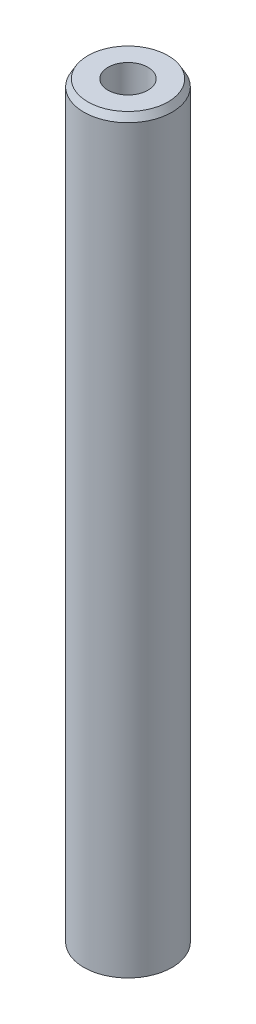
ISO-10303-21;
HEADER;
FILE_DESCRIPTION(('STEP AP214'),'2;1');
FILE_NAME('part.step','',(''),(''),'','','');
FILE_SCHEMA(('AUTOMOTIVE_DESIGN { 1 0 10303 214 1 1 1 1 }'));
ENDSEC;
DATA;
#1=APPLICATION_CONTEXT('core data for automotive mechanical design processes');
#2=APPLICATION_PROTOCOL_DEFINITION('international standard','automotive_design',2000,#1);
#3=PRODUCT_CONTEXT('',#1,'mechanical');
#4=PRODUCT('Part','Part','',(#3));
#5=PRODUCT_RELATED_PRODUCT_CATEGORY('part','',(#4));
#6=PRODUCT_DEFINITION_FORMATION('','',#4);
#7=PRODUCT_DEFINITION_CONTEXT('part definition',#1,'design');
#8=PRODUCT_DEFINITION('design','',#6,#7);
#9=PRODUCT_DEFINITION_SHAPE('','',#8);
#10=(LENGTH_UNIT() NAMED_UNIT(*) SI_UNIT(.MILLI.,.METRE.));
#11=(NAMED_UNIT(*) PLANE_ANGLE_UNIT() SI_UNIT($,.RADIAN.));
#12=(NAMED_UNIT(*) SI_UNIT($,.STERADIAN.) SOLID_ANGLE_UNIT());
#13=UNCERTAINTY_MEASURE_WITH_UNIT(LENGTH_MEASURE(1.E-05),#10,'distance_accuracy_value','');
#14=(GEOMETRIC_REPRESENTATION_CONTEXT(3) GLOBAL_UNCERTAINTY_ASSIGNED_CONTEXT((#13)) GLOBAL_UNIT_ASSIGNED_CONTEXT((#10,
#11,#12)) REPRESENTATION_CONTEXT('',''));
#15=CARTESIAN_POINT('',(0.,0.,0.));
#16=DIRECTION('',(0.,0.,1.));
#17=DIRECTION('',(1.,0.,0.));
#18=AXIS2_PLACEMENT_3D('',#15,#16,#17);
#19=CARTESIAN_POINT('',(0.,596.406810650082,0.));
#20=DIRECTION('',(0.,-1.,0.));
#21=DIRECTION('',(0.,0.,-1.));
#22=AXIS2_PLACEMENT_3D('',#19,#20,#21);
#23=CYLINDRICAL_SURFACE('',#22,35.);
#24=CARTESIAN_POINT('',(0.,590.915027687392,0.));
#25=DIRECTION('',(0.,1.,0.));
#26=DIRECTION('',(0.,0.,1.));
#27=AXIS2_PLACEMENT_3D('',#24,#25,#26);
#28=CIRCLE('',#27,35.);
#29=CARTESIAN_POINT('',(0.,590.915027687392,35.));
#30=VERTEX_POINT('',#29);
#31=EDGE_CURVE('E50',#30,#30,#28,.F.);
#32=ORIENTED_EDGE('',*,*,#31,.T.);
#33=EDGE_LOOP('',(#32));
#34=FACE_BOUND('',#33,.T.);
#35=CARTESIAN_POINT('',(0.,3.17068237184026,0.));
#36=DIRECTION('',(0.,1.,0.));
#37=DIRECTION('',(0.,0.,1.));
#38=AXIS2_PLACEMENT_3D('',#35,#36,#37);
#39=CIRCLE('',#38,35.);
#40=CARTESIAN_POINT('',(0.,3.17068237184026,35.));
#41=VERTEX_POINT('',#40);
#42=EDGE_CURVE('E51',#41,#41,#39,.T.);
#43=ORIENTED_EDGE('',*,*,#42,.T.);
#44=EDGE_LOOP('',(#43));
#45=FACE_BOUND('',#44,.T.);
#46=ADVANCED_FACE('F39',(#34,#45),#23,.T.);
#47=CARTESIAN_POINT('',(0.,596.406810650082,0.));
#48=DIRECTION('',(0.,1.,0.));
#49=DIRECTION('',(0.,0.,1.));
#50=AXIS2_PLACEMENT_3D('',#47,#48,#49);
#51=PLANE('',#50);
#52=CARTESIAN_POINT('',(0.,596.406810650082,0.));
#53=DIRECTION('',(0.,1.,0.));
#54=DIRECTION('',(0.,0.,1.));
#55=AXIS2_PLACEMENT_3D('',#52,#53,#54);
#56=CIRCLE('',#55,31.8293176281599);
#57=CARTESIAN_POINT('',(0.,596.406810650082,31.8293176281599));
#58=VERTEX_POINT('',#57);
#59=EDGE_CURVE('E54',#58,#58,#56,.T.);
#60=ORIENTED_EDGE('',*,*,#59,.T.);
#61=EDGE_LOOP('',(#60));
#62=FACE_BOUND('',#61,.T.);
#63=CARTESIAN_POINT('',(0.,596.406810650082,0.));
#64=DIRECTION('',(0.,1.,0.));
#65=DIRECTION('',(0.,0.,1.));
#66=AXIS2_PLACEMENT_3D('',#63,#64,#65);
#67=CIRCLE('',#66,15.8222151897171);
#68=CARTESIAN_POINT('',(0.,596.406810650082,15.8222151897171));
#69=VERTEX_POINT('',#68);
#70=EDGE_CURVE('E58',#69,#69,#67,.T.);
#71=ORIENTED_EDGE('',*,*,#70,.F.);
#72=EDGE_LOOP('',(#71));
#73=FACE_BOUND('',#72,.T.);
#74=ADVANCED_FACE('F69',(#62,#73),#51,.T.);
#75=CARTESIAN_POINT('',(0.,0.,0.));
#76=DIRECTION('',(0.,1.,0.));
#77=DIRECTION('',(0.,0.,1.));
#78=AXIS2_PLACEMENT_3D('',#75,#76,#77);
#79=PLANE('',#78);
#80=CARTESIAN_POINT('',(0.,0.,0.));
#81=DIRECTION('',(0.,1.,0.));
#82=DIRECTION('',(0.,0.,1.));
#83=AXIS2_PLACEMENT_3D('',#80,#81,#82);
#84=CIRCLE('',#83,29.5082170373097);
#85=CARTESIAN_POINT('',(0.,0.,29.5082170373097));
#86=VERTEX_POINT('',#85);
#87=EDGE_CURVE('E10',#86,#86,#84,.F.);
#88=ORIENTED_EDGE('',*,*,#87,.T.);
#89=EDGE_LOOP('',(#88));
#90=FACE_BOUND('',#89,.T.);
#91=CARTESIAN_POINT('',(0.,0.,0.));
#92=DIRECTION('',(0.,1.,0.));
#93=DIRECTION('',(0.,0.,1.));
#94=AXIS2_PLACEMENT_3D('',#91,#92,#93);
#95=CIRCLE('',#94,15.8222151897171);
#96=CARTESIAN_POINT('',(0.,0.,15.8222151897171));
#97=VERTEX_POINT('',#96);
#98=EDGE_CURVE('E63',#97,#97,#95,.T.);
#99=ORIENTED_EDGE('',*,*,#98,.T.);
#100=EDGE_LOOP('',(#99));
#101=FACE_BOUND('',#100,.T.);
#102=ADVANCED_FACE('F75',(#90,#101),#79,.F.);
#103=CARTESIAN_POINT('',(0.,596.406810650082,0.));
#104=DIRECTION('',(0.,-1.,0.));
#105=DIRECTION('',(0.,0.,-1.));
#106=AXIS2_PLACEMENT_3D('',#103,#104,#105);
#107=CYLINDRICAL_SURFACE('',#106,15.8222151897171);
#108=ORIENTED_EDGE('',*,*,#70,.T.);
#109=EDGE_LOOP('',(#108));
#110=FACE_BOUND('',#109,.T.);
#111=ORIENTED_EDGE('',*,*,#98,.F.);
#112=EDGE_LOOP('',(#111));
#113=FACE_BOUND('',#112,.T.);
#114=ADVANCED_FACE('F70',(#110,#113),#107,.F.);
#115=CARTESIAN_POINT('',(0.,596.406810650082,0.));
#116=DIRECTION('',(0.,-1.,0.));
#117=DIRECTION('',(0.,0.,-1.));
#118=AXIS2_PLACEMENT_3D('',#115,#116,#117);
#119=CONICAL_SURFACE('',#118,31.8293176281599,0.523598775598295);
#120=ORIENTED_EDGE('',*,*,#31,.F.);
#121=EDGE_LOOP('',(#120));
#122=FACE_BOUND('',#121,.T.);
#123=ORIENTED_EDGE('',*,*,#59,.F.);
#124=EDGE_LOOP('',(#123));
#125=FACE_BOUND('',#124,.T.);
#126=ADVANCED_FACE('F81',(#122,#125),#119,.T.);
#127=CARTESIAN_POINT('',(0.,3.17068237184026,0.));
#128=DIRECTION('',(0.,1.,0.));
#129=DIRECTION('',(0.,0.,1.));
#130=AXIS2_PLACEMENT_3D('',#127,#128,#129);
#131=CONICAL_SURFACE('',#130,35.,1.0471975511966);
#132=ORIENTED_EDGE('',*,*,#87,.F.);
#133=EDGE_LOOP('',(#132));
#134=FACE_BOUND('',#133,.T.);
#135=ORIENTED_EDGE('',*,*,#42,.F.);
#136=EDGE_LOOP('',(#135));
#137=FACE_BOUND('',#136,.T.);
#138=ADVANCED_FACE('F45',(#134,#137),#131,.T.);
#139=CLOSED_SHELL('',(#46,#74,#102,#114,#126,#138));
#140=MANIFOLD_SOLID_BREP('B2',#139);
#141=ADVANCED_BREP_SHAPE_REPRESENTATION('',(#18,#140),#14);
#142=SHAPE_DEFINITION_REPRESENTATION(#9,#141);
ENDSEC;
END-ISO-10303-21;
